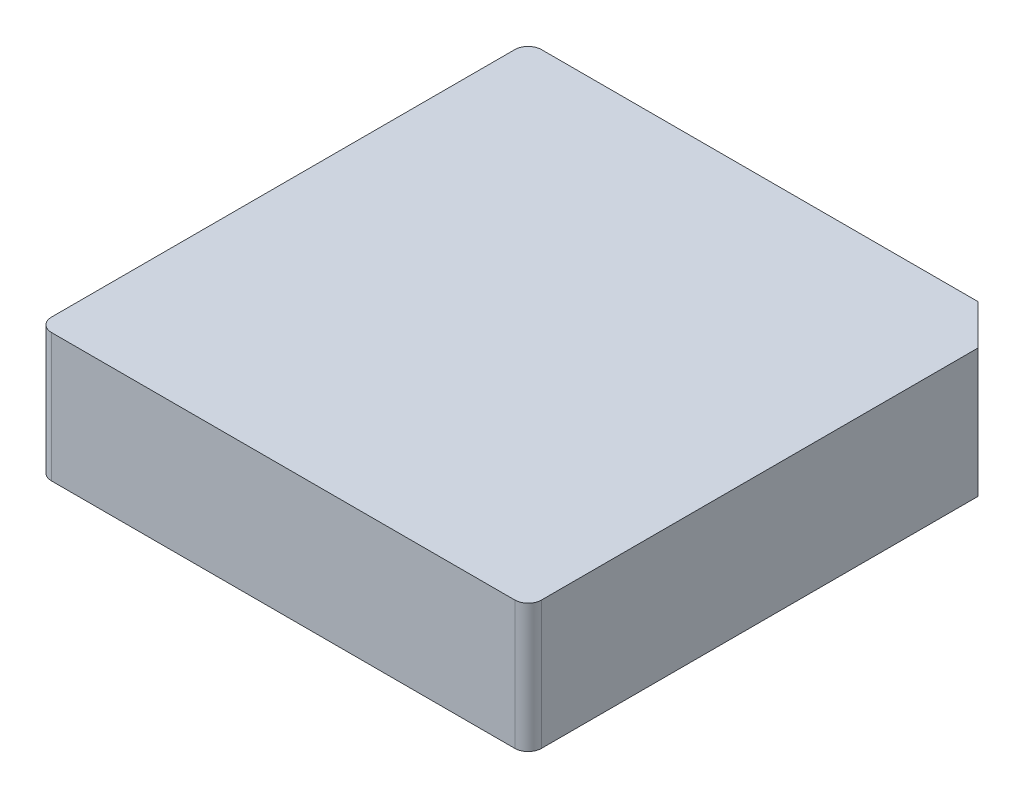
ISO-10303-21;
HEADER;
FILE_DESCRIPTION(('STEP AP214'),'2;1');
FILE_NAME('part.step','',(''),(''),'','','');
FILE_SCHEMA(('AUTOMOTIVE_DESIGN { 1 0 10303 214 1 1 1 1 }'));
ENDSEC;
DATA;
#1=APPLICATION_CONTEXT('core data for automotive mechanical design processes');
#2=APPLICATION_PROTOCOL_DEFINITION('international standard','automotive_design',2000,#1);
#3=PRODUCT_CONTEXT('',#1,'mechanical');
#4=PRODUCT('Part','Part','',(#3));
#5=PRODUCT_RELATED_PRODUCT_CATEGORY('part','',(#4));
#6=PRODUCT_DEFINITION_FORMATION('','',#4);
#7=PRODUCT_DEFINITION_CONTEXT('part definition',#1,'design');
#8=PRODUCT_DEFINITION('design','',#6,#7);
#9=PRODUCT_DEFINITION_SHAPE('','',#8);
#10=(LENGTH_UNIT() NAMED_UNIT(*) SI_UNIT(.MILLI.,.METRE.));
#11=(NAMED_UNIT(*) PLANE_ANGLE_UNIT() SI_UNIT($,.RADIAN.));
#12=(NAMED_UNIT(*) SI_UNIT($,.STERADIAN.) SOLID_ANGLE_UNIT());
#13=UNCERTAINTY_MEASURE_WITH_UNIT(LENGTH_MEASURE(1.E-05),#10,'distance_accuracy_value','');
#14=(GEOMETRIC_REPRESENTATION_CONTEXT(3) GLOBAL_UNCERTAINTY_ASSIGNED_CONTEXT((#13)) GLOBAL_UNIT_ASSIGNED_CONTEXT((#10,
#11,#12)) REPRESENTATION_CONTEXT('',''));
#15=CARTESIAN_POINT('',(0.,0.,0.));
#16=DIRECTION('',(0.,0.,1.));
#17=DIRECTION('',(1.,0.,0.));
#18=AXIS2_PLACEMENT_3D('',#15,#16,#17);
#19=CARTESIAN_POINT('',(0.,0.,0.));
#20=DIRECTION('',(0.,1.,0.));
#21=DIRECTION('',(0.,0.,1.));
#22=AXIS2_PLACEMENT_3D('',#19,#20,#21);
#23=PLANE('',#22);
#24=DIRECTION('',(0.,0.,-1.));
#25=VECTOR('',#24,1.);
#26=CARTESIAN_POINT('',(-9.15,0.,0.));
#27=LINE('',#26,#25);
#28=CARTESIAN_POINT('',(-9.15,0.,8.65));
#29=VERTEX_POINT('',#28);
#30=CARTESIAN_POINT('',(-9.15,0.,-8.65));
#31=VERTEX_POINT('',#30);
#32=EDGE_CURVE('E141',#29,#31,#27,.T.);
#33=ORIENTED_EDGE('',*,*,#32,.T.);
#34=CARTESIAN_POINT('',(-8.65,0.,-8.65));
#35=DIRECTION('',(0.,1.,0.));
#36=DIRECTION('',(0.,0.,1.));
#37=AXIS2_PLACEMENT_3D('',#34,#35,#36);
#38=CIRCLE('',#37,0.5);
#39=CARTESIAN_POINT('',(-8.65,0.,-9.15));
#40=VERTEX_POINT('',#39);
#41=EDGE_CURVE('E153',#31,#40,#38,.F.);
#42=ORIENTED_EDGE('',*,*,#41,.T.);
#43=DIRECTION('',(1.,0.,0.));
#44=VECTOR('',#43,1.);
#45=CARTESIAN_POINT('',(0.,0.,-9.15));
#46=LINE('',#45,#44);
#47=CARTESIAN_POINT('',(7.65,0.,-9.15));
#48=VERTEX_POINT('',#47);
#49=EDGE_CURVE('E139',#40,#48,#46,.T.);
#50=ORIENTED_EDGE('',*,*,#49,.T.);
#51=DIRECTION('',(0.707106781186548,0.,0.707106781186548));
#52=VECTOR('',#51,1.);
#53=CARTESIAN_POINT('',(8.4,0.,-8.4));
#54=LINE('',#53,#52);
#55=CARTESIAN_POINT('',(9.15,0.,-7.65));
#56=VERTEX_POINT('',#55);
#57=EDGE_CURVE('E137',#48,#56,#54,.T.);
#58=ORIENTED_EDGE('',*,*,#57,.T.);
#59=DIRECTION('',(0.,0.,-1.));
#60=VECTOR('',#59,1.);
#61=CARTESIAN_POINT('',(9.15,0.,0.));
#62=LINE('',#61,#60);
#63=CARTESIAN_POINT('',(9.15,0.,8.65));
#64=VERTEX_POINT('',#63);
#65=EDGE_CURVE('E115',#64,#56,#62,.T.);
#66=ORIENTED_EDGE('',*,*,#65,.F.);
#67=CARTESIAN_POINT('',(8.65,0.,8.65));
#68=DIRECTION('',(0.,1.,0.));
#69=DIRECTION('',(0.,0.,1.));
#70=AXIS2_PLACEMENT_3D('',#67,#68,#69);
#71=CIRCLE('',#70,0.5);
#72=CARTESIAN_POINT('',(8.65,0.,9.15));
#73=VERTEX_POINT('',#72);
#74=EDGE_CURVE('E149',#64,#73,#71,.F.);
#75=ORIENTED_EDGE('',*,*,#74,.T.);
#76=DIRECTION('',(1.,0.,0.));
#77=VECTOR('',#76,1.);
#78=CARTESIAN_POINT('',(0.,0.,9.15));
#79=LINE('',#78,#77);
#80=CARTESIAN_POINT('',(-8.65,0.,9.15));
#81=VERTEX_POINT('',#80);
#82=EDGE_CURVE('E133',#81,#73,#79,.T.);
#83=ORIENTED_EDGE('',*,*,#82,.F.);
#84=CARTESIAN_POINT('',(-8.65,0.,8.65));
#85=DIRECTION('',(0.,1.,0.));
#86=DIRECTION('',(0.,0.,1.));
#87=AXIS2_PLACEMENT_3D('',#84,#85,#86);
#88=CIRCLE('',#87,0.5);
#89=EDGE_CURVE('E151',#81,#29,#88,.F.);
#90=ORIENTED_EDGE('',*,*,#89,.T.);
#91=EDGE_LOOP('',(#33,#42,#50,#58,#66,#75,#83,#90));
#92=FACE_BOUND('',#91,.T.);
#93=CARTESIAN_POINT('',(0.,0.,1.8));
#94=DIRECTION('',(0.,1.,0.));
#95=DIRECTION('',(0.,0.,1.));
#96=AXIS2_PLACEMENT_3D('',#93,#94,#95);
#97=CIRCLE('',#96,0.475);
#98=CARTESIAN_POINT('',(0.,0.,2.275));
#99=VERTEX_POINT('',#98);
#100=EDGE_CURVE('E11',#99,#99,#97,.F.);
#101=ORIENTED_EDGE('',*,*,#100,.F.);
#102=EDGE_LOOP('',(#101));
#103=FACE_BOUND('',#102,.T.);
#104=ADVANCED_FACE('F35',(#92,#103),#23,.F.);
#105=CARTESIAN_POINT('',(0.,4.8,9.15));
#106=DIRECTION('',(0.,0.,-1.));
#107=DIRECTION('',(-1.,0.,0.));
#108=AXIS2_PLACEMENT_3D('',#105,#106,#107);
#109=PLANE('',#108);
#110=DIRECTION('',(1.,0.,0.));
#111=VECTOR('',#110,1.);
#112=CARTESIAN_POINT('',(0.,4.8,9.15));
#113=LINE('',#112,#111);
#114=CARTESIAN_POINT('',(-8.65,4.8,9.15));
#115=VERTEX_POINT('',#114);
#116=CARTESIAN_POINT('',(8.65,4.8,9.15));
#117=VERTEX_POINT('',#116);
#118=EDGE_CURVE('E109',#115,#117,#113,.T.);
#119=ORIENTED_EDGE('',*,*,#118,.F.);
#120=DIRECTION('',(0.,-1.,0.));
#121=VECTOR('',#120,1.);
#122=CARTESIAN_POINT('',(-8.65,0.,9.15));
#123=LINE('',#122,#121);
#124=EDGE_CURVE('E163',#115,#81,#123,.T.);
#125=ORIENTED_EDGE('',*,*,#124,.T.);
#126=ORIENTED_EDGE('',*,*,#82,.T.);
#127=DIRECTION('',(0.,-1.,0.));
#128=VECTOR('',#127,1.);
#129=CARTESIAN_POINT('',(8.65,4.8,9.15));
#130=LINE('',#129,#128);
#131=EDGE_CURVE('E58',#73,#117,#130,.F.);
#132=ORIENTED_EDGE('',*,*,#131,.T.);
#133=EDGE_LOOP('',(#119,#125,#126,#132));
#134=FACE_BOUND('',#133,.T.);
#135=ADVANCED_FACE('F186',(#134),#109,.F.);
#136=CARTESIAN_POINT('',(9.15,4.8,0.));
#137=DIRECTION('',(-1.,0.,0.));
#138=DIRECTION('',(0.,0.,1.));
#139=AXIS2_PLACEMENT_3D('',#136,#137,#138);
#140=PLANE('',#139);
#141=DIRECTION('',(0.,0.,-1.));
#142=VECTOR('',#141,1.);
#143=CARTESIAN_POINT('',(9.15,4.8,0.));
#144=LINE('',#143,#142);
#145=CARTESIAN_POINT('',(9.15,4.8,8.65));
#146=VERTEX_POINT('',#145);
#147=CARTESIAN_POINT('',(9.15,4.8,-7.65));
#148=VERTEX_POINT('',#147);
#149=EDGE_CURVE('E100',#146,#148,#144,.T.);
#150=ORIENTED_EDGE('',*,*,#149,.F.);
#151=DIRECTION('',(0.,-1.,0.));
#152=VECTOR('',#151,1.);
#153=CARTESIAN_POINT('',(9.15,4.8,8.65));
#154=LINE('',#153,#152);
#155=EDGE_CURVE('E43',#146,#64,#154,.T.);
#156=ORIENTED_EDGE('',*,*,#155,.T.);
#157=ORIENTED_EDGE('',*,*,#65,.T.);
#158=DIRECTION('',(0.,-1.,0.));
#159=VECTOR('',#158,1.);
#160=CARTESIAN_POINT('',(9.15,4.8,-7.65));
#161=LINE('',#160,#159);
#162=EDGE_CURVE('E112',#148,#56,#161,.T.);
#163=ORIENTED_EDGE('',*,*,#162,.F.);
#164=EDGE_LOOP('',(#150,#156,#157,#163));
#165=FACE_BOUND('',#164,.T.);
#166=ADVANCED_FACE('F113',(#165),#140,.F.);
#167=CARTESIAN_POINT('',(8.4,4.8,-8.4));
#168=DIRECTION('',(0.707106781186548,0.,-0.707106781186548));
#169=DIRECTION('',(-0.707106781186548,0.,-0.707106781186548));
#170=AXIS2_PLACEMENT_3D('',#167,#168,#169);
#171=PLANE('',#170);
#172=ORIENTED_EDGE('',*,*,#57,.F.);
#173=DIRECTION('',(0.,-1.,0.));
#174=VECTOR('',#173,1.);
#175=CARTESIAN_POINT('',(7.65,4.8,-9.15));
#176=LINE('',#175,#174);
#177=CARTESIAN_POINT('',(7.65,4.8,-9.15));
#178=VERTEX_POINT('',#177);
#179=EDGE_CURVE('E120',#178,#48,#176,.T.);
#180=ORIENTED_EDGE('',*,*,#179,.F.);
#181=DIRECTION('',(0.707106781186548,0.,0.707106781186548));
#182=VECTOR('',#181,1.);
#183=CARTESIAN_POINT('',(8.4,4.8,-8.4));
#184=LINE('',#183,#182);
#185=EDGE_CURVE('E105',#178,#148,#184,.T.);
#186=ORIENTED_EDGE('',*,*,#185,.T.);
#187=ORIENTED_EDGE('',*,*,#162,.T.);
#188=EDGE_LOOP('',(#172,#180,#186,#187));
#189=FACE_BOUND('',#188,.T.);
#190=ADVANCED_FACE('F123',(#189),#171,.T.);
#191=CARTESIAN_POINT('',(0.,4.8,-9.15));
#192=DIRECTION('',(0.,0.,-1.));
#193=DIRECTION('',(-1.,0.,0.));
#194=AXIS2_PLACEMENT_3D('',#191,#192,#193);
#195=PLANE('',#194);
#196=ORIENTED_EDGE('',*,*,#49,.F.);
#197=DIRECTION('',(0.,-1.,0.));
#198=VECTOR('',#197,1.);
#199=CARTESIAN_POINT('',(-8.65,4.8,-9.15));
#200=LINE('',#199,#198);
#201=CARTESIAN_POINT('',(-8.65,4.8,-9.15));
#202=VERTEX_POINT('',#201);
#203=EDGE_CURVE('E155',#40,#202,#200,.F.);
#204=ORIENTED_EDGE('',*,*,#203,.T.);
#205=DIRECTION('',(1.,0.,0.));
#206=VECTOR('',#205,1.);
#207=CARTESIAN_POINT('',(0.,4.8,-9.15));
#208=LINE('',#207,#206);
#209=EDGE_CURVE('E125',#202,#178,#208,.T.);
#210=ORIENTED_EDGE('',*,*,#209,.T.);
#211=ORIENTED_EDGE('',*,*,#179,.T.);
#212=EDGE_LOOP('',(#196,#204,#210,#211));
#213=FACE_BOUND('',#212,.T.);
#214=ADVANCED_FACE('F172',(#213),#195,.T.);
#215=CARTESIAN_POINT('',(-9.15,4.8,0.));
#216=DIRECTION('',(-1.,0.,0.));
#217=DIRECTION('',(0.,0.,1.));
#218=AXIS2_PLACEMENT_3D('',#215,#216,#217);
#219=PLANE('',#218);
#220=DIRECTION('',(0.,0.,-1.));
#221=VECTOR('',#220,1.);
#222=CARTESIAN_POINT('',(-9.15,4.8,0.));
#223=LINE('',#222,#221);
#224=CARTESIAN_POINT('',(-9.15,4.8,8.65));
#225=VERTEX_POINT('',#224);
#226=CARTESIAN_POINT('',(-9.15,4.8,-8.65));
#227=VERTEX_POINT('',#226);
#228=EDGE_CURVE('E127',#225,#227,#223,.T.);
#229=ORIENTED_EDGE('',*,*,#228,.T.);
#230=DIRECTION('',(0.,-1.,0.));
#231=VECTOR('',#230,1.);
#232=CARTESIAN_POINT('',(-9.15,4.8,-8.65));
#233=LINE('',#232,#231);
#234=EDGE_CURVE('E146',#227,#31,#233,.T.);
#235=ORIENTED_EDGE('',*,*,#234,.T.);
#236=ORIENTED_EDGE('',*,*,#32,.F.);
#237=DIRECTION('',(0.,-1.,0.));
#238=VECTOR('',#237,1.);
#239=CARTESIAN_POINT('',(-9.15,4.8,8.65));
#240=LINE('',#239,#238);
#241=EDGE_CURVE('E119',#29,#225,#240,.F.);
#242=ORIENTED_EDGE('',*,*,#241,.T.);
#243=EDGE_LOOP('',(#229,#235,#236,#242));
#244=FACE_BOUND('',#243,.T.);
#245=ADVANCED_FACE('F180',(#244),#219,.T.);
#246=CARTESIAN_POINT('',(0.,4.8,0.));
#247=DIRECTION('',(0.,1.,0.));
#248=DIRECTION('',(0.,0.,1.));
#249=AXIS2_PLACEMENT_3D('',#246,#247,#248);
#250=PLANE('',#249);
#251=ORIENTED_EDGE('',*,*,#209,.F.);
#252=CARTESIAN_POINT('',(-8.65,4.8,-8.65));
#253=DIRECTION('',(0.,1.,0.));
#254=DIRECTION('',(0.,0.,1.));
#255=AXIS2_PLACEMENT_3D('',#252,#253,#254);
#256=CIRCLE('',#255,0.5);
#257=EDGE_CURVE('E160',#202,#227,#256,.T.);
#258=ORIENTED_EDGE('',*,*,#257,.T.);
#259=ORIENTED_EDGE('',*,*,#228,.F.);
#260=CARTESIAN_POINT('',(-8.65,4.8,8.65));
#261=DIRECTION('',(0.,1.,0.));
#262=DIRECTION('',(0.,0.,1.));
#263=AXIS2_PLACEMENT_3D('',#260,#261,#262);
#264=CIRCLE('',#263,0.5);
#265=EDGE_CURVE('E158',#225,#115,#264,.T.);
#266=ORIENTED_EDGE('',*,*,#265,.T.);
#267=ORIENTED_EDGE('',*,*,#118,.T.);
#268=CARTESIAN_POINT('',(8.65,4.8,8.65));
#269=DIRECTION('',(0.,1.,0.));
#270=DIRECTION('',(0.,0.,1.));
#271=AXIS2_PLACEMENT_3D('',#268,#269,#270);
#272=CIRCLE('',#271,0.5);
#273=EDGE_CURVE('E50',#117,#146,#272,.T.);
#274=ORIENTED_EDGE('',*,*,#273,.T.);
#275=ORIENTED_EDGE('',*,*,#149,.T.);
#276=ORIENTED_EDGE('',*,*,#185,.F.);
#277=EDGE_LOOP('',(#251,#258,#259,#266,#267,#274,#275,#276));
#278=FACE_BOUND('',#277,.T.);
#279=ADVANCED_FACE('F103',(#278),#250,.T.);
#280=CARTESIAN_POINT('',(-8.65,4.8,-8.65));
#281=DIRECTION('',(0.,-1.,0.));
#282=DIRECTION('',(0.,0.,-1.));
#283=AXIS2_PLACEMENT_3D('',#280,#281,#282);
#284=CYLINDRICAL_SURFACE('',#283,0.5);
#285=ORIENTED_EDGE('',*,*,#257,.F.);
#286=ORIENTED_EDGE('',*,*,#203,.F.);
#287=ORIENTED_EDGE('',*,*,#41,.F.);
#288=ORIENTED_EDGE('',*,*,#234,.F.);
#289=EDGE_LOOP('',(#285,#286,#287,#288));
#290=FACE_BOUND('',#289,.T.);
#291=ADVANCED_FACE('F177',(#290),#284,.T.);
#292=CARTESIAN_POINT('',(-8.65,4.8,8.65));
#293=DIRECTION('',(0.,1.,0.));
#294=DIRECTION('',(0.,0.,1.));
#295=AXIS2_PLACEMENT_3D('',#292,#293,#294);
#296=CYLINDRICAL_SURFACE('',#295,0.5);
#297=ORIENTED_EDGE('',*,*,#265,.F.);
#298=ORIENTED_EDGE('',*,*,#241,.F.);
#299=ORIENTED_EDGE('',*,*,#89,.F.);
#300=ORIENTED_EDGE('',*,*,#124,.F.);
#301=EDGE_LOOP('',(#297,#298,#299,#300));
#302=FACE_BOUND('',#301,.T.);
#303=ADVANCED_FACE('F185',(#302),#296,.T.);
#304=CARTESIAN_POINT('',(8.65,4.8,8.65));
#305=DIRECTION('',(0.,-1.,0.));
#306=DIRECTION('',(0.,0.,-1.));
#307=AXIS2_PLACEMENT_3D('',#304,#305,#306);
#308=CYLINDRICAL_SURFACE('',#307,0.5);
#309=ORIENTED_EDGE('',*,*,#273,.F.);
#310=ORIENTED_EDGE('',*,*,#131,.F.);
#311=ORIENTED_EDGE('',*,*,#74,.F.);
#312=ORIENTED_EDGE('',*,*,#155,.F.);
#313=EDGE_LOOP('',(#309,#310,#311,#312));
#314=FACE_BOUND('',#313,.T.);
#315=ADVANCED_FACE('F37',(#314),#308,.T.);
#316=CARTESIAN_POINT('',(0.,-1.9,1.8));
#317=DIRECTION('',(0.,1.,0.));
#318=DIRECTION('',(0.,0.,1.));
#319=AXIS2_PLACEMENT_3D('',#316,#317,#318);
#320=CYLINDRICAL_SURFACE('',#319,0.475);
#321=CARTESIAN_POINT('',(0.,-1.9,1.8));
#322=DIRECTION('',(0.,-1.,0.));
#323=DIRECTION('',(0.,0.,-1.));
#324=AXIS2_PLACEMENT_3D('',#321,#322,#323);
#325=CIRCLE('',#324,0.475);
#326=CARTESIAN_POINT('',(0.,-1.9,1.325));
#327=VERTEX_POINT('',#326);
#328=EDGE_CURVE('E135',#327,#327,#325,.T.);
#329=ORIENTED_EDGE('',*,*,#328,.F.);
#330=EDGE_LOOP('',(#329));
#331=FACE_BOUND('',#330,.T.);
#332=ORIENTED_EDGE('',*,*,#100,.T.);
#333=EDGE_LOOP('',(#332));
#334=FACE_BOUND('',#333,.T.);
#335=ADVANCED_FACE('F193',(#331,#334),#320,.T.);
#336=CARTESIAN_POINT('',(0.,-1.9,1.8));
#337=DIRECTION('',(0.,-1.,0.));
#338=DIRECTION('',(0.,0.,-1.));
#339=AXIS2_PLACEMENT_3D('',#336,#337,#338);
#340=PLANE('',#339);
#341=ORIENTED_EDGE('',*,*,#328,.T.);
#342=EDGE_LOOP('',(#341));
#343=FACE_BOUND('',#342,.T.);
#344=ADVANCED_FACE('F191',(#343),#340,.T.);
#345=CLOSED_SHELL('',(#104,#135,#166,#190,#214,#245,#279,#291,#303,#315,#335,#344));
#346=MANIFOLD_SOLID_BREP('B2',#345);
#347=ADVANCED_BREP_SHAPE_REPRESENTATION('',(#18,#346),#14);
#348=SHAPE_DEFINITION_REPRESENTATION(#9,#347);
ENDSEC;
END-ISO-10303-21;
